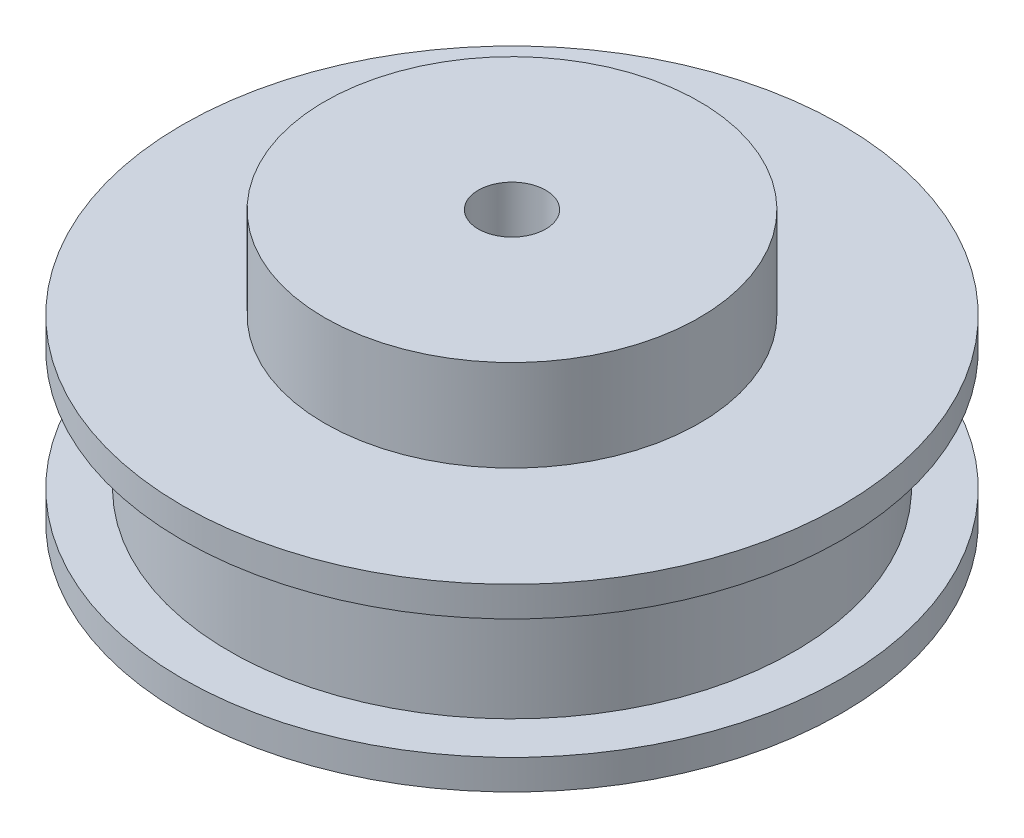
ISO-10303-21;
HEADER;
FILE_DESCRIPTION(('STEP AP214'),'2;1');
FILE_NAME('part.step','',(''),(''),'','','');
FILE_SCHEMA(('AUTOMOTIVE_DESIGN { 1 0 10303 214 1 1 1 1 }'));
ENDSEC;
DATA;
#1=APPLICATION_CONTEXT('core data for automotive mechanical design processes');
#2=APPLICATION_PROTOCOL_DEFINITION('international standard','automotive_design',2000,#1);
#3=PRODUCT_CONTEXT('',#1,'mechanical');
#4=PRODUCT('Part','Part','',(#3));
#5=PRODUCT_RELATED_PRODUCT_CATEGORY('part','',(#4));
#6=PRODUCT_DEFINITION_FORMATION('','',#4);
#7=PRODUCT_DEFINITION_CONTEXT('part definition',#1,'design');
#8=PRODUCT_DEFINITION('design','',#6,#7);
#9=PRODUCT_DEFINITION_SHAPE('','',#8);
#10=(LENGTH_UNIT() NAMED_UNIT(*) SI_UNIT(.MILLI.,.METRE.));
#11=(NAMED_UNIT(*) PLANE_ANGLE_UNIT() SI_UNIT($,.RADIAN.));
#12=(NAMED_UNIT(*) SI_UNIT($,.STERADIAN.) SOLID_ANGLE_UNIT());
#13=UNCERTAINTY_MEASURE_WITH_UNIT(LENGTH_MEASURE(1.E-05),#10,'distance_accuracy_value','');
#14=(GEOMETRIC_REPRESENTATION_CONTEXT(3) GLOBAL_UNCERTAINTY_ASSIGNED_CONTEXT((#13)) GLOBAL_UNIT_ASSIGNED_CONTEXT((#10,
#11,#12)) REPRESENTATION_CONTEXT('',''));
#15=CARTESIAN_POINT('',(0.,0.,0.));
#16=DIRECTION('',(0.,0.,1.));
#17=DIRECTION('',(1.,0.,0.));
#18=AXIS2_PLACEMENT_3D('',#15,#16,#17);
#19=CARTESIAN_POINT('',(0.,10.,0.));
#20=DIRECTION('',(0.,-1.,0.));
#21=DIRECTION('',(0.,0.,-1.));
#22=AXIS2_PLACEMENT_3D('',#19,#20,#21);
#23=CYLINDRICAL_SURFACE('',#22,22.);
#24=CARTESIAN_POINT('',(0.,10.,0.));
#25=DIRECTION('',(0.,1.,0.));
#26=DIRECTION('',(0.,0.,1.));
#27=AXIS2_PLACEMENT_3D('',#24,#25,#26);
#28=CIRCLE('',#27,22.);
#29=CARTESIAN_POINT('',(0.,10.,22.));
#30=VERTEX_POINT('',#29);
#31=EDGE_CURVE('E44',#30,#30,#28,.T.);
#32=ORIENTED_EDGE('',*,*,#31,.F.);
#33=EDGE_LOOP('',(#32));
#34=FACE_BOUND('',#33,.T.);
#35=CARTESIAN_POINT('',(0.,8.,0.));
#36=DIRECTION('',(0.,-1.,0.));
#37=DIRECTION('',(0.,0.,-1.));
#38=AXIS2_PLACEMENT_3D('',#35,#36,#37);
#39=CIRCLE('',#38,22.);
#40=CARTESIAN_POINT('',(0.,8.,-22.));
#41=VERTEX_POINT('',#40);
#42=EDGE_CURVE('E55',#41,#41,#39,.T.);
#43=ORIENTED_EDGE('',*,*,#42,.F.);
#44=EDGE_LOOP('',(#43));
#45=FACE_BOUND('',#44,.T.);
#46=ADVANCED_FACE('F41',(#34,#45),#23,.T.);
#47=CARTESIAN_POINT('',(0.,10.,0.));
#48=DIRECTION('',(0.,1.,0.));
#49=DIRECTION('',(0.,0.,1.));
#50=AXIS2_PLACEMENT_3D('',#47,#48,#49);
#51=PLANE('',#50);
#52=CARTESIAN_POINT('',(0.,10.,0.));
#53=DIRECTION('',(0.,1.,0.));
#54=DIRECTION('',(0.,0.,1.));
#55=AXIS2_PLACEMENT_3D('',#52,#53,#54);
#56=CIRCLE('',#55,12.5);
#57=CARTESIAN_POINT('',(0.,10.,12.5));
#58=VERTEX_POINT('',#57);
#59=EDGE_CURVE('E11',#58,#58,#56,.T.);
#60=ORIENTED_EDGE('',*,*,#59,.F.);
#61=EDGE_LOOP('',(#60));
#62=FACE_BOUND('',#61,.T.);
#63=ORIENTED_EDGE('',*,*,#31,.T.);
#64=EDGE_LOOP('',(#63));
#65=FACE_BOUND('',#64,.T.);
#66=ADVANCED_FACE('F103',(#62,#65),#51,.T.);
#67=CARTESIAN_POINT('',(0.,16.1,0.));
#68=DIRECTION('',(0.,-1.,0.));
#69=DIRECTION('',(0.,0.,-1.));
#70=AXIS2_PLACEMENT_3D('',#67,#68,#69);
#71=CYLINDRICAL_SURFACE('',#70,12.5);
#72=CARTESIAN_POINT('',(0.,16.1,0.));
#73=DIRECTION('',(0.,1.,0.));
#74=DIRECTION('',(0.,0.,1.));
#75=AXIS2_PLACEMENT_3D('',#72,#73,#74);
#76=CIRCLE('',#75,12.5);
#77=CARTESIAN_POINT('',(0.,16.1,12.5));
#78=VERTEX_POINT('',#77);
#79=EDGE_CURVE('E51',#78,#78,#76,.T.);
#80=ORIENTED_EDGE('',*,*,#79,.F.);
#81=EDGE_LOOP('',(#80));
#82=FACE_BOUND('',#81,.T.);
#83=ORIENTED_EDGE('',*,*,#59,.T.);
#84=EDGE_LOOP('',(#83));
#85=FACE_BOUND('',#84,.T.);
#86=ADVANCED_FACE('F108',(#82,#85),#71,.T.);
#87=CARTESIAN_POINT('',(0.,16.1,0.));
#88=DIRECTION('',(0.,1.,0.));
#89=DIRECTION('',(0.,0.,1.));
#90=AXIS2_PLACEMENT_3D('',#87,#88,#89);
#91=PLANE('',#90);
#92=CARTESIAN_POINT('',(0.,16.1,0.));
#93=DIRECTION('',(0.,1.,0.));
#94=DIRECTION('',(0.,0.,1.));
#95=AXIS2_PLACEMENT_3D('',#92,#93,#94);
#96=CIRCLE('',#95,2.25);
#97=CARTESIAN_POINT('',(0.,16.1,2.25));
#98=VERTEX_POINT('',#97);
#99=EDGE_CURVE('E68',#98,#98,#96,.T.);
#100=ORIENTED_EDGE('',*,*,#99,.F.);
#101=EDGE_LOOP('',(#100));
#102=FACE_BOUND('',#101,.T.);
#103=ORIENTED_EDGE('',*,*,#79,.T.);
#104=EDGE_LOOP('',(#103));
#105=FACE_BOUND('',#104,.T.);
#106=ADVANCED_FACE('F116',(#102,#105),#91,.T.);
#107=CARTESIAN_POINT('',(0.,8.,0.));
#108=DIRECTION('',(0.,-1.,0.));
#109=DIRECTION('',(0.,0.,-1.));
#110=AXIS2_PLACEMENT_3D('',#107,#108,#109);
#111=PLANE('',#110);
#112=CARTESIAN_POINT('',(0.,8.,0.));
#113=DIRECTION('',(0.,-1.,0.));
#114=DIRECTION('',(0.,0.,-1.));
#115=AXIS2_PLACEMENT_3D('',#112,#113,#114);
#116=CIRCLE('',#115,18.85);
#117=CARTESIAN_POINT('',(0.,8.,-18.85));
#118=VERTEX_POINT('',#117);
#119=EDGE_CURVE('E58',#118,#118,#116,.T.);
#120=ORIENTED_EDGE('',*,*,#119,.F.);
#121=EDGE_LOOP('',(#120));
#122=FACE_BOUND('',#121,.T.);
#123=ORIENTED_EDGE('',*,*,#42,.T.);
#124=EDGE_LOOP('',(#123));
#125=FACE_BOUND('',#124,.T.);
#126=ADVANCED_FACE('F114',(#122,#125),#111,.T.);
#127=CARTESIAN_POINT('',(0.,8.,0.));
#128=DIRECTION('',(0.,-1.,0.));
#129=DIRECTION('',(0.,0.,-1.));
#130=AXIS2_PLACEMENT_3D('',#127,#128,#129);
#131=CYLINDRICAL_SURFACE('',#130,18.85);
#132=ORIENTED_EDGE('',*,*,#119,.T.);
#133=EDGE_LOOP('',(#132));
#134=FACE_BOUND('',#133,.T.);
#135=CARTESIAN_POINT('',(0.,0.,0.));
#136=DIRECTION('',(0.,-1.,0.));
#137=DIRECTION('',(0.,0.,-1.));
#138=AXIS2_PLACEMENT_3D('',#135,#136,#137);
#139=CIRCLE('',#138,18.85);
#140=CARTESIAN_POINT('',(0.,0.,-18.85));
#141=VERTEX_POINT('',#140);
#142=EDGE_CURVE('E59',#141,#141,#139,.T.);
#143=ORIENTED_EDGE('',*,*,#142,.F.);
#144=EDGE_LOOP('',(#143));
#145=FACE_BOUND('',#144,.T.);
#146=ADVANCED_FACE('F89',(#134,#145),#131,.T.);
#147=CARTESIAN_POINT('',(0.,-2.,0.));
#148=DIRECTION('',(0.,1.,0.));
#149=DIRECTION('',(0.,0.,1.));
#150=AXIS2_PLACEMENT_3D('',#147,#148,#149);
#151=CYLINDRICAL_SURFACE('',#150,22.);
#152=CARTESIAN_POINT('',(0.,-2.,0.));
#153=DIRECTION('',(0.,-1.,0.));
#154=DIRECTION('',(0.,0.,-1.));
#155=AXIS2_PLACEMENT_3D('',#152,#153,#154);
#156=CIRCLE('',#155,22.);
#157=CARTESIAN_POINT('',(0.,-2.,-22.));
#158=VERTEX_POINT('',#157);
#159=EDGE_CURVE('E62',#158,#158,#156,.T.);
#160=ORIENTED_EDGE('',*,*,#159,.F.);
#161=EDGE_LOOP('',(#160));
#162=FACE_BOUND('',#161,.T.);
#163=CARTESIAN_POINT('',(0.,0.,0.));
#164=DIRECTION('',(0.,-1.,0.));
#165=DIRECTION('',(0.,0.,-1.));
#166=AXIS2_PLACEMENT_3D('',#163,#164,#165);
#167=CIRCLE('',#166,22.);
#168=CARTESIAN_POINT('',(0.,0.,-22.));
#169=VERTEX_POINT('',#168);
#170=EDGE_CURVE('E65',#169,#169,#167,.T.);
#171=ORIENTED_EDGE('',*,*,#170,.T.);
#172=EDGE_LOOP('',(#171));
#173=FACE_BOUND('',#172,.T.);
#174=ADVANCED_FACE('F83',(#162,#173),#151,.T.);
#175=CARTESIAN_POINT('',(0.,-2.,0.));
#176=DIRECTION('',(0.,-1.,0.));
#177=DIRECTION('',(0.,0.,-1.));
#178=AXIS2_PLACEMENT_3D('',#175,#176,#177);
#179=PLANE('',#178);
#180=CARTESIAN_POINT('',(0.,-2.,0.));
#181=DIRECTION('',(0.,-1.,0.));
#182=DIRECTION('',(0.,0.,-1.));
#183=AXIS2_PLACEMENT_3D('',#180,#181,#182);
#184=CIRCLE('',#183,2.25);
#185=CARTESIAN_POINT('',(0.,-2.,-2.25));
#186=VERTEX_POINT('',#185);
#187=EDGE_CURVE('E73',#186,#186,#184,.T.);
#188=ORIENTED_EDGE('',*,*,#187,.F.);
#189=EDGE_LOOP('',(#188));
#190=FACE_BOUND('',#189,.T.);
#191=ORIENTED_EDGE('',*,*,#159,.T.);
#192=EDGE_LOOP('',(#191));
#193=FACE_BOUND('',#192,.T.);
#194=ADVANCED_FACE('F79',(#190,#193),#179,.T.);
#195=CARTESIAN_POINT('',(0.,0.,0.));
#196=DIRECTION('',(0.,-1.,0.));
#197=DIRECTION('',(0.,0.,-1.));
#198=AXIS2_PLACEMENT_3D('',#195,#196,#197);
#199=PLANE('',#198);
#200=ORIENTED_EDGE('',*,*,#142,.T.);
#201=EDGE_LOOP('',(#200));
#202=FACE_BOUND('',#201,.T.);
#203=ORIENTED_EDGE('',*,*,#170,.F.);
#204=EDGE_LOOP('',(#203));
#205=FACE_BOUND('',#204,.T.);
#206=ADVANCED_FACE('F82',(#202,#205),#199,.F.);
#207=CARTESIAN_POINT('',(0.,26.,0.));
#208=DIRECTION('',(0.,-1.,0.));
#209=DIRECTION('',(0.,0.,-1.));
#210=AXIS2_PLACEMENT_3D('',#207,#208,#209);
#211=CYLINDRICAL_SURFACE('',#210,2.25);
#212=ORIENTED_EDGE('',*,*,#99,.T.);
#213=EDGE_LOOP('',(#212));
#214=FACE_BOUND('',#213,.T.);
#215=ORIENTED_EDGE('',*,*,#187,.T.);
#216=EDGE_LOOP('',(#215));
#217=FACE_BOUND('',#216,.T.);
#218=ADVANCED_FACE('F77',(#214,#217),#211,.F.);
#219=CLOSED_SHELL('',(#46,#66,#86,#106,#126,#146,#174,#194,#206,#218));
#220=MANIFOLD_SOLID_BREP('B2',#219);
#221=ADVANCED_BREP_SHAPE_REPRESENTATION('',(#18,#220),#14);
#222=SHAPE_DEFINITION_REPRESENTATION(#9,#221);
ENDSEC;
END-ISO-10303-21;
